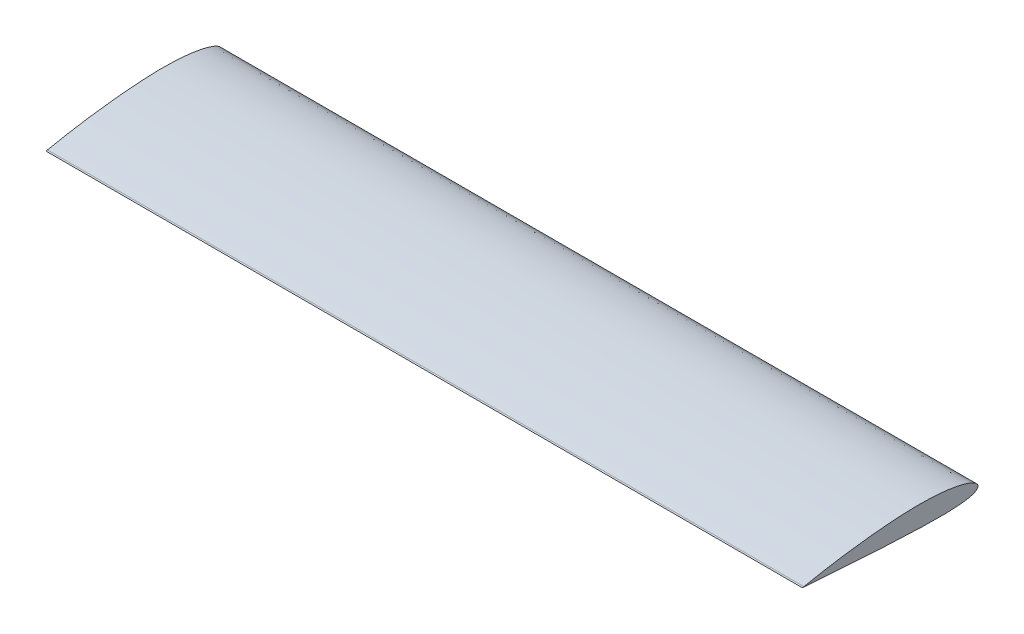
ISO-10303-21;
HEADER;
FILE_DESCRIPTION(('STEP AP214'),'2;1');
FILE_NAME('part.step','',(''),(''),'','','');
FILE_SCHEMA(('AUTOMOTIVE_DESIGN { 1 0 10303 214 1 1 1 1 }'));
ENDSEC;
DATA;
#1=APPLICATION_CONTEXT('core data for automotive mechanical design processes');
#2=APPLICATION_PROTOCOL_DEFINITION('international standard','automotive_design',2000,#1);
#3=PRODUCT_CONTEXT('',#1,'mechanical');
#4=PRODUCT('Part','Part','',(#3));
#5=PRODUCT_RELATED_PRODUCT_CATEGORY('part','',(#4));
#6=PRODUCT_DEFINITION_FORMATION('','',#4);
#7=PRODUCT_DEFINITION_CONTEXT('part definition',#1,'design');
#8=PRODUCT_DEFINITION('design','',#6,#7);
#9=PRODUCT_DEFINITION_SHAPE('','',#8);
#10=(LENGTH_UNIT() NAMED_UNIT(*) SI_UNIT(.MILLI.,.METRE.));
#11=(NAMED_UNIT(*) PLANE_ANGLE_UNIT() SI_UNIT($,.RADIAN.));
#12=(NAMED_UNIT(*) SI_UNIT($,.STERADIAN.) SOLID_ANGLE_UNIT());
#13=UNCERTAINTY_MEASURE_WITH_UNIT(LENGTH_MEASURE(1.E-05),#10,'distance_accuracy_value','');
#14=(GEOMETRIC_REPRESENTATION_CONTEXT(3) GLOBAL_UNCERTAINTY_ASSIGNED_CONTEXT((#13)) GLOBAL_UNIT_ASSIGNED_CONTEXT((#10,
#11,#12)) REPRESENTATION_CONTEXT('',''));
#15=CARTESIAN_POINT('',(0.,0.,0.));
#16=DIRECTION('',(0.,0.,1.));
#17=DIRECTION('',(1.,0.,0.));
#18=AXIS2_PLACEMENT_3D('',#15,#16,#17);
#19=CARTESIAN_POINT('',(1000.,-0.57822,459.96136));
#20=CARTESIAN_POINT('',(1000.,-0.595546201064765,459.722926633538));
#21=CARTESIAN_POINT('',(1000.,-0.664750446535169,458.770577000786));
#22=CARTESIAN_POINT('',(1000.,-0.820097255996696,456.633473904951));
#23=CARTESIAN_POINT('',(1000.,-1.07534391474096,453.087022947326));
#24=CARTESIAN_POINT('',(1000.,-1.42904485861535,448.154516429648));
#25=CARTESIAN_POINT('',(1000.,-1.87534160046032,441.868019551717));
#26=CARTESIAN_POINT('',(1000.,-2.41063614763183,434.268423290275));
#27=CARTESIAN_POINT('',(1000.,-3.02832414407909,425.404870433179));
#28=CARTESIAN_POINT('',(1000.,-3.72250159129677,415.334397244788));
#29=CARTESIAN_POINT('',(1000.,-4.48816981443587,404.121471111217));
#30=CARTESIAN_POINT('',(1000.,-5.31801226489666,391.837751080439));
#31=CARTESIAN_POINT('',(1000.,-6.20789426904348,378.56128593132));
#32=CARTESIAN_POINT('',(1000.,-7.14892944368918,364.376091401711));
#33=CARTESIAN_POINT('',(1000.,-8.13611252478126,349.37141060841));
#34=CARTESIAN_POINT('',(1000.,-9.16036931936446,333.64146900815));
#35=CARTESIAN_POINT('',(1000.,-10.2130313140034,317.284462612016));
#36=CARTESIAN_POINT('',(1000.,-11.2828230425378,300.402068620946));
#37=CARTESIAN_POINT('',(1000.,-12.3546879740502,283.098611655093));
#38=CARTESIAN_POINT('',(1000.,-13.4148938429502,265.480797863899));
#39=CARTESIAN_POINT('',(1000.,-14.4427416600801,247.656722582026));
#40=CARTESIAN_POINT('',(1000.,-15.41954298534,229.735221004216));
#41=CARTESIAN_POINT('',(1000.,-16.3175433696275,211.825044664784));
#42=CARTESIAN_POINT('',(1000.,-17.1171729174978,194.055351039072));
#43=CARTESIAN_POINT('',(1000.,-17.7784070462407,176.559622724169));
#44=CARTESIAN_POINT('',(1000.,-18.3821806374611,159.445496034057));
#45=CARTESIAN_POINT('',(1000.,-18.8863453183243,142.790888208118));
#46=CARTESIAN_POINT('',(1000.,-19.2643358170726,126.664381158158));
#47=CARTESIAN_POINT('',(1000.,-19.4833451509986,111.157748758866));
#48=CARTESIAN_POINT('',(1000.,-19.5166912406896,96.3593078576507));
#49=CARTESIAN_POINT('',(1000.,-19.337915860042,82.3537795065244));
#50=CARTESIAN_POINT('',(1000.,-18.9276132990026,69.2218030676485));
#51=CARTESIAN_POINT('',(1000.,-18.2686902362068,57.0399261441836));
#52=CARTESIAN_POINT('',(1000.,-17.3506381049654,45.8798657132097));
#53=CARTESIAN_POINT('',(1000.,-16.1657077336599,35.8081819993711));
#54=CARTESIAN_POINT('',(1000.,-14.7119962857562,26.8852921936776));
#55=CARTESIAN_POINT('',(1000.,-12.9908095825222,19.1637052686143));
#56=CARTESIAN_POINT('',(1000.,-11.0065243272819,12.6856393324366));
#57=CARTESIAN_POINT('',(1000.,-8.7569038403763,7.47821590859919));
#58=CARTESIAN_POINT('',(1000.,-6.23046498881112,3.55014802399322));
#59=CARTESIAN_POINT('',(1000.,-3.34511785643728,0.902718938149594));
#60=CARTESIAN_POINT('',(1000.,-0.0262679214766239,-0.262262833066601));
#61=CARTESIAN_POINT('',(1000.,3.46075278320734,0.22334044441311));
#62=CARTESIAN_POINT('',(1000.,6.81404068614428,2.26861760929261));
#63=CARTESIAN_POINT('',(1000.,10.0569976368771,5.6671116034625));
#64=CARTESIAN_POINT('',(1000.,13.2541060266416,10.416631233785));
#65=CARTESIAN_POINT('',(1000.,16.3986940706502,16.5144729539643));
#66=CARTESIAN_POINT('',(1000.,19.4595480473288,23.9454326511999));
#67=CARTESIAN_POINT('',(1000.,22.3959258336671,32.6748608018245));
#68=CARTESIAN_POINT('',(1000.,25.1611831983686,42.6566076203779));
#69=CARTESIAN_POINT('',(1000.,27.7126134163392,53.8315990565819));
#70=CARTESIAN_POINT('',(1000.,30.0044835376801,66.1323734849929));
#71=CARTESIAN_POINT('',(1000.,31.9979313574114,79.4811032247787));
#72=CARTESIAN_POINT('',(1000.,33.6576842455689,93.7922020979673));
#73=CARTESIAN_POINT('',(1000.,34.9558833702082,108.972143146884));
#74=CARTESIAN_POINT('',(1000.,35.8696929379504,124.921332833881));
#75=CARTESIAN_POINT('',(1000.,36.3855250637185,141.534269901525));
#76=CARTESIAN_POINT('',(1000.,36.4971322300513,158.701138058617));
#77=CARTESIAN_POINT('',(1000.,36.207087084995,176.282304318349));
#78=CARTESIAN_POINT('',(1000.,35.5176780689537,194.141133769773));
#79=CARTESIAN_POINT('',(1000.,34.5557033069161,212.167609701362));
#80=CARTESIAN_POINT('',(1000.,33.3336597867544,230.275245945925));
#81=CARTESIAN_POINT('',(1000.,31.880450428852,248.371165835517));
#82=CARTESIAN_POINT('',(1000.,30.2198271390663,266.342124234926));
#83=CARTESIAN_POINT('',(1000.,28.3853068495781,284.076486433119));
#84=CARTESIAN_POINT('',(1000.,26.4035574067418,301.464229530884));
#85=CARTESIAN_POINT('',(1000.,24.3092612062564,318.398290140492));
#86=CARTESIAN_POINT('',(1000.,22.1323738571071,334.774661071771));
#87=CARTESIAN_POINT('',(1000.,19.9051051501624,350.493218457132));
#88=CARTESIAN_POINT('',(1000.,17.6608430753493,365.458406812589));
#89=CARTESIAN_POINT('',(1000.,15.4318192121894,379.579206865228));
#90=CARTESIAN_POINT('',(1000.,13.250829113558,392.770491908562));
#91=CARTESIAN_POINT('',(1000.,11.1514360991052,404.953123159227));
#92=CARTESIAN_POINT('',(1000.,9.16541605825495,416.054516581583));
#93=CARTESIAN_POINT('',(1000.,7.32369837103478,426.008341953398));
#94=CARTESIAN_POINT('',(1000.,5.65763481007658,434.756002280408));
#95=CARTESIAN_POINT('',(1000.,4.19430067339885,442.24599338));
#96=CARTESIAN_POINT('',(1000.,2.95894186603859,448.434337026262));
#97=CARTESIAN_POINT('',(1000.,1.97457405051952,453.28530188676));
#98=CARTESIAN_POINT('',(1000.,1.25748810221199,456.77023400302));
#99=CARTESIAN_POINT('',(1000.,0.821814131438473,458.86928327524));
#100=CARTESIAN_POINT('',(1000.,0.62699417607731,459.804502952224));
#101=CARTESIAN_POINT('',(1000.,0.57822,460.03864));
#102=B_SPLINE_CURVE_WITH_KNOTS('',3,(#19,#20,#21,#22,#23,#24,#25,#26,#27,#28,#29,#30,#31,#32,
#33,#34,#35,#36,#37,#38,#39,#40,#41,#42,#43,#44,#45,#46,#47,#48,#49,#50,#51,#52,#53,#54,#55,#56,
#57,#58,#59,#60,#61,#62,#63,#64,#65,#66,#67,#68,#69,#70,#71,#72,#73,#74,#75,#76,#77,#78,#79,#80,
#81,#82,#83,#84,#85,#86,#87,#88,#89,#90,#91,#92,#93,#94,#95,#96,#97,#98,#99,#100,#101),
.UNSPECIFIED.,.F.,.F.,(4,1,1,1,1,1,1,1,1,1,1,1,1,1,1,1,1,1,1,1,1,1,1,1,1,1,1,1,1,1,1,1,1,1,1,1,
1,1,1,1,1,1,1,1,1,1,1,1,1,1,1,1,1,1,1,1,1,1,1,1,1,1,1,1,1,1,1,1,1,1,1,1,1,1,1,1,1,1,1,1,4),(0.,
0.000763849001500838,0.00305096273583516,0.00684646955224621,0.0121247484862888,
0.0188517323013395,0.0269835822459312,0.036467072952227,0.0472411623624426,0.0592370237492688,
0.0723779439548288,0.0865794557279205,0.101753050357609,0.117801975084679,0.134625927408028,
0.15211965624753,0.170173849863638,0.188676584211923,0.207513463209848,0.226567927798734,
0.245722459831779,0.264860936987902,0.283866077458523,0.302557043653414,0.320802791746688,
0.338582940766319,0.355795759860566,0.372343677759343,0.388133630608251,0.403078328240631,
0.417095611775281,0.430110357882856,0.442054549095498,0.452868818715277,0.462505009146628,
0.470928785019175,0.478127761278921,0.484123875338212,0.488999972182062,0.492959403174825,
0.496412777697822,0.499866609506216,0.503832176080471,0.508732461778435,0.51477966167091,
0.522066384116654,0.530620554720804,0.540434572011856,0.551477175550533,0.563701851231184,
0.577048547245343,0.591447280896427,0.606818147252312,0.623074182281721,0.640120289431202,
0.657856183183399,0.676175563379063,0.694967819833854,0.714033957187982,0.733277175195403,
0.752646098718606,0.772021105338392,0.7912817902148,0.810310109979621,0.828987081513378,
0.847197702829786,0.864829110746378,0.881772296963255,0.897922602456206,0.913179947694549,
0.927449194878037,0.940643128994877,0.952679251989813,0.963483187916785,0.972987160696187,
0.981132008479951,0.987867526601434,0.993150194295179,0.996947646215246,0.999235827558466,1.),.UNSPECIFIED.);
#103=DIRECTION('',(-1.,0.,0.));
#104=VECTOR('',#103,1.);
#105=SURFACE_OF_LINEAR_EXTRUSION('',#102,#104);
#106=CARTESIAN_POINT('',(-1000.,-0.57822,459.96136));
#107=CARTESIAN_POINT('',(-1000.,-0.595546201064765,459.722926633538));
#108=CARTESIAN_POINT('',(-1000.,-0.664750446535169,458.770577000786));
#109=CARTESIAN_POINT('',(-1000.,-0.820097255996696,456.633473904951));
#110=CARTESIAN_POINT('',(-1000.,-1.07534391474096,453.087022947326));
#111=CARTESIAN_POINT('',(-1000.,-1.42904485861535,448.154516429648));
#112=CARTESIAN_POINT('',(-1000.,-1.87534160046032,441.868019551717));
#113=CARTESIAN_POINT('',(-1000.,-2.41063614763183,434.268423290275));
#114=CARTESIAN_POINT('',(-1000.,-3.02832414407909,425.404870433179));
#115=CARTESIAN_POINT('',(-1000.,-3.72250159129677,415.334397244788));
#116=CARTESIAN_POINT('',(-1000.,-4.48816981443587,404.121471111217));
#117=CARTESIAN_POINT('',(-1000.,-5.31801226489666,391.837751080439));
#118=CARTESIAN_POINT('',(-1000.,-6.20789426904348,378.56128593132));
#119=CARTESIAN_POINT('',(-1000.,-7.14892944368918,364.376091401711));
#120=CARTESIAN_POINT('',(-1000.,-8.13611252478126,349.37141060841));
#121=CARTESIAN_POINT('',(-1000.,-9.16036931936446,333.64146900815));
#122=CARTESIAN_POINT('',(-1000.,-10.2130313140034,317.284462612016));
#123=CARTESIAN_POINT('',(-1000.,-11.2828230425378,300.402068620946));
#124=CARTESIAN_POINT('',(-1000.,-12.3546879740502,283.098611655093));
#125=CARTESIAN_POINT('',(-1000.,-13.4148938429502,265.480797863899));
#126=CARTESIAN_POINT('',(-1000.,-14.4427416600801,247.656722582026));
#127=CARTESIAN_POINT('',(-1000.,-15.41954298534,229.735221004216));
#128=CARTESIAN_POINT('',(-1000.,-16.3175433696275,211.825044664784));
#129=CARTESIAN_POINT('',(-1000.,-17.1171729174978,194.055351039072));
#130=CARTESIAN_POINT('',(-1000.,-17.7784070462407,176.559622724169));
#131=CARTESIAN_POINT('',(-1000.,-18.3821806374611,159.445496034057));
#132=CARTESIAN_POINT('',(-1000.,-18.8863453183243,142.790888208118));
#133=CARTESIAN_POINT('',(-1000.,-19.2643358170726,126.664381158158));
#134=CARTESIAN_POINT('',(-1000.,-19.4833451509986,111.157748758866));
#135=CARTESIAN_POINT('',(-1000.,-19.5166912406896,96.3593078576507));
#136=CARTESIAN_POINT('',(-1000.,-19.337915860042,82.3537795065244));
#137=CARTESIAN_POINT('',(-1000.,-18.9276132990026,69.2218030676485));
#138=CARTESIAN_POINT('',(-1000.,-18.2686902362068,57.0399261441836));
#139=CARTESIAN_POINT('',(-1000.,-17.3506381049654,45.8798657132097));
#140=CARTESIAN_POINT('',(-1000.,-16.1657077336599,35.8081819993711));
#141=CARTESIAN_POINT('',(-1000.,-14.7119962857562,26.8852921936776));
#142=CARTESIAN_POINT('',(-1000.,-12.9908095825222,19.1637052686143));
#143=CARTESIAN_POINT('',(-1000.,-11.0065243272819,12.6856393324366));
#144=CARTESIAN_POINT('',(-1000.,-8.7569038403763,7.47821590859919));
#145=CARTESIAN_POINT('',(-1000.,-6.23046498881112,3.55014802399322));
#146=CARTESIAN_POINT('',(-1000.,-3.34511785643728,0.902718938149594));
#147=CARTESIAN_POINT('',(-1000.,-0.0262679214766239,-0.262262833066601));
#148=CARTESIAN_POINT('',(-1000.,3.46075278320734,0.22334044441311));
#149=CARTESIAN_POINT('',(-1000.,6.81404068614428,2.26861760929261));
#150=CARTESIAN_POINT('',(-1000.,10.0569976368771,5.6671116034625));
#151=CARTESIAN_POINT('',(-1000.,13.2541060266416,10.416631233785));
#152=CARTESIAN_POINT('',(-1000.,16.3986940706502,16.5144729539643));
#153=CARTESIAN_POINT('',(-1000.,19.4595480473288,23.9454326511999));
#154=CARTESIAN_POINT('',(-1000.,22.3959258336671,32.6748608018245));
#155=CARTESIAN_POINT('',(-1000.,25.1611831983686,42.6566076203779));
#156=CARTESIAN_POINT('',(-1000.,27.7126134163392,53.8315990565819));
#157=CARTESIAN_POINT('',(-1000.,30.0044835376801,66.1323734849929));
#158=CARTESIAN_POINT('',(-1000.,31.9979313574114,79.4811032247787));
#159=CARTESIAN_POINT('',(-1000.,33.6576842455689,93.7922020979673));
#160=CARTESIAN_POINT('',(-1000.,34.9558833702082,108.972143146884));
#161=CARTESIAN_POINT('',(-1000.,35.8696929379504,124.921332833881));
#162=CARTESIAN_POINT('',(-1000.,36.3855250637185,141.534269901525));
#163=CARTESIAN_POINT('',(-1000.,36.4971322300513,158.701138058617));
#164=CARTESIAN_POINT('',(-1000.,36.207087084995,176.282304318349));
#165=CARTESIAN_POINT('',(-1000.,35.5176780689537,194.141133769773));
#166=CARTESIAN_POINT('',(-1000.,34.5557033069161,212.167609701362));
#167=CARTESIAN_POINT('',(-1000.,33.3336597867544,230.275245945925));
#168=CARTESIAN_POINT('',(-1000.,31.880450428852,248.371165835517));
#169=CARTESIAN_POINT('',(-1000.,30.2198271390663,266.342124234926));
#170=CARTESIAN_POINT('',(-1000.,28.3853068495781,284.076486433119));
#171=CARTESIAN_POINT('',(-1000.,26.4035574067418,301.464229530884));
#172=CARTESIAN_POINT('',(-1000.,24.3092612062564,318.398290140492));
#173=CARTESIAN_POINT('',(-1000.,22.1323738571071,334.774661071771));
#174=CARTESIAN_POINT('',(-1000.,19.9051051501624,350.493218457132));
#175=CARTESIAN_POINT('',(-1000.,17.6608430753493,365.458406812589));
#176=CARTESIAN_POINT('',(-1000.,15.4318192121894,379.579206865228));
#177=CARTESIAN_POINT('',(-1000.,13.250829113558,392.770491908562));
#178=CARTESIAN_POINT('',(-1000.,11.1514360991052,404.953123159227));
#179=CARTESIAN_POINT('',(-1000.,9.16541605825495,416.054516581583));
#180=CARTESIAN_POINT('',(-1000.,7.32369837103478,426.008341953398));
#181=CARTESIAN_POINT('',(-1000.,5.65763481007658,434.756002280408));
#182=CARTESIAN_POINT('',(-1000.,4.19430067339885,442.24599338));
#183=CARTESIAN_POINT('',(-1000.,2.95894186603859,448.434337026262));
#184=CARTESIAN_POINT('',(-1000.,1.97457405051952,453.28530188676));
#185=CARTESIAN_POINT('',(-1000.,1.25748810221199,456.77023400302));
#186=CARTESIAN_POINT('',(-1000.,0.821814131438473,458.86928327524));
#187=CARTESIAN_POINT('',(-1000.,0.62699417607731,459.804502952224));
#188=CARTESIAN_POINT('',(-1000.,0.57822,460.03864));
#189=B_SPLINE_CURVE_WITH_KNOTS('',3,(#106,#107,#108,#109,#110,#111,#112,#113,#114,#115,#116,
#117,#118,#119,#120,#121,#122,#123,#124,#125,#126,#127,#128,#129,#130,#131,#132,#133,#134,#135,
#136,#137,#138,#139,#140,#141,#142,#143,#144,#145,#146,#147,#148,#149,#150,#151,#152,#153,#154,
#155,#156,#157,#158,#159,#160,#161,#162,#163,#164,#165,#166,#167,#168,#169,#170,#171,#172,#173,
#174,#175,#176,#177,#178,#179,#180,#181,#182,#183,#184,#185,#186,#187,#188),.UNSPECIFIED.,.F.,
.F.,(4,1,1,1,1,1,1,1,1,1,1,1,1,1,1,1,1,1,1,1,1,1,1,1,1,1,1,1,1,1,1,1,1,1,1,1,1,1,1,1,1,1,1,1,1,
1,1,1,1,1,1,1,1,1,1,1,1,1,1,1,1,1,1,1,1,1,1,1,1,1,1,1,1,1,1,1,1,1,1,1,4),(0.,
0.000763849001500838,0.00305096273583516,0.00684646955224621,0.0121247484862888,
0.0188517323013395,0.0269835822459312,0.036467072952227,0.0472411623624426,0.0592370237492688,
0.0723779439548288,0.0865794557279205,0.101753050357609,0.117801975084679,0.134625927408028,
0.15211965624753,0.170173849863638,0.188676584211923,0.207513463209848,0.226567927798734,
0.245722459831779,0.264860936987902,0.283866077458523,0.302557043653414,0.320802791746688,
0.338582940766319,0.355795759860566,0.372343677759343,0.388133630608251,0.403078328240631,
0.417095611775281,0.430110357882856,0.442054549095498,0.452868818715277,0.462505009146628,
0.470928785019175,0.478127761278921,0.484123875338212,0.488999972182062,0.492959403174825,
0.496412777697822,0.499866609506216,0.503832176080471,0.508732461778435,0.51477966167091,
0.522066384116654,0.530620554720804,0.540434572011856,0.551477175550533,0.563701851231184,
0.577048547245343,0.591447280896427,0.606818147252312,0.623074182281721,0.640120289431202,
0.657856183183399,0.676175563379063,0.694967819833854,0.714033957187982,0.733277175195403,
0.752646098718606,0.772021105338392,0.7912817902148,0.810310109979621,0.828987081513378,
0.847197702829786,0.864829110746378,0.881772296963255,0.897922602456206,0.913179947694549,
0.927449194878037,0.940643128994877,0.952679251989813,0.963483187916785,0.972987160696187,
0.981132008479951,0.987867526601434,0.993150194295179,0.996947646215246,0.999235827558466,1.),.UNSPECIFIED.);
#190=CARTESIAN_POINT('',(-1000.,-0.57822,459.96136));
#191=VERTEX_POINT('',#190);
#192=CARTESIAN_POINT('',(-1000.,0.57822,460.03864));
#193=VERTEX_POINT('',#192);
#194=EDGE_CURVE('E95',#191,#193,#189,.T.);
#195=ORIENTED_EDGE('',*,*,#194,.T.);
#196=DIRECTION('',(-1.,0.,0.));
#197=VECTOR('',#196,1.);
#198=CARTESIAN_POINT('',(1000.,0.57822,460.03864));
#199=LINE('',#198,#197);
#200=CARTESIAN_POINT('',(1000.,0.57822,460.03864));
#201=VERTEX_POINT('',#200);
#202=EDGE_CURVE('E11',#201,#193,#199,.T.);
#203=ORIENTED_EDGE('',*,*,#202,.F.);
#204=CARTESIAN_POINT('',(1000.,-0.57822,459.96136));
#205=VERTEX_POINT('',#204);
#206=EDGE_CURVE('E88',#205,#201,#102,.T.);
#207=ORIENTED_EDGE('',*,*,#206,.F.);
#208=DIRECTION('',(-1.,0.,0.));
#209=VECTOR('',#208,1.);
#210=CARTESIAN_POINT('',(1000.,-0.57822,459.96136));
#211=LINE('',#210,#209);
#212=EDGE_CURVE('E96',#205,#191,#211,.T.);
#213=ORIENTED_EDGE('',*,*,#212,.T.);
#214=EDGE_LOOP('',(#195,#203,#207,#213));
#215=FACE_BOUND('',#214,.T.);
#216=ADVANCED_FACE('F45',(#215),#105,.F.);
#217=CARTESIAN_POINT('',(1000.,0.57822,460.03864));
#218=DIRECTION('',(0.,-0.978984072534473,-0.203936719900603));
#219=DIRECTION('',(0.,0.203936719900603,-0.978984072534473));
#220=AXIS2_PLACEMENT_3D('',#217,#218,#219);
#221=PLANE('',#220);
#222=DIRECTION('',(0.,-0.203936719900603,0.978984072534473));
#223=VECTOR('',#222,1.);
#224=CARTESIAN_POINT('',(-1000.,0.57822,460.03864));
#225=LINE('',#224,#223);
#226=CARTESIAN_POINT('',(-1000.,-0.259696924143734,464.06100205056));
#227=VERTEX_POINT('',#226);
#228=EDGE_CURVE('E75',#193,#227,#225,.T.);
#229=ORIENTED_EDGE('',*,*,#228,.T.);
#230=DIRECTION('',(-1.,0.,0.));
#231=VECTOR('',#230,1.);
#232=CARTESIAN_POINT('',(1000.,-0.259696924143734,464.06100205056));
#233=LINE('',#232,#231);
#234=CARTESIAN_POINT('',(1000.,-0.259696924143734,464.06100205056));
#235=VERTEX_POINT('',#234);
#236=EDGE_CURVE('E55',#235,#227,#233,.T.);
#237=ORIENTED_EDGE('',*,*,#236,.F.);
#238=DIRECTION('',(0.,-0.203936719900603,0.978984072534473));
#239=VECTOR('',#238,1.);
#240=CARTESIAN_POINT('',(1000.,0.57822,460.03864));
#241=LINE('',#240,#239);
#242=EDGE_CURVE('E83',#201,#235,#241,.T.);
#243=ORIENTED_EDGE('',*,*,#242,.F.);
#244=ORIENTED_EDGE('',*,*,#202,.T.);
#245=EDGE_LOOP('',(#229,#237,#243,#244));
#246=FACE_BOUND('',#245,.T.);
#247=ADVANCED_FACE('F84',(#246),#221,.F.);
#248=CARTESIAN_POINT('',(1000.,-0.57822,459.96136));
#249=DIRECTION('',(0.,0.996995313872502,-0.0774618881532858));
#250=DIRECTION('',(0.,0.0774618881532858,0.996995313872502));
#251=AXIS2_PLACEMENT_3D('',#248,#249,#250);
#252=PLANE('',#251);
#253=DIRECTION('',(0.,-0.0774618881532858,-0.996995313872502));
#254=VECTOR('',#253,1.);
#255=CARTESIAN_POINT('',(-1000.,-0.57822,459.96136));
#256=LINE('',#255,#254);
#257=EDGE_CURVE('E80',#227,#191,#256,.T.);
#258=ORIENTED_EDGE('',*,*,#257,.T.);
#259=ORIENTED_EDGE('',*,*,#212,.F.);
#260=DIRECTION('',(0.,-0.0774618881532858,-0.996995313872502));
#261=VECTOR('',#260,1.);
#262=CARTESIAN_POINT('',(1000.,-0.57822,459.96136));
#263=LINE('',#262,#261);
#264=EDGE_CURVE('E63',#235,#205,#263,.T.);
#265=ORIENTED_EDGE('',*,*,#264,.F.);
#266=ORIENTED_EDGE('',*,*,#236,.T.);
#267=EDGE_LOOP('',(#258,#259,#265,#266));
#268=FACE_BOUND('',#267,.T.);
#269=ADVANCED_FACE('F113',(#268),#252,.F.);
#270=CARTESIAN_POINT('',(1000.,3.33757172506848,0.436946661892542));
#271=DIRECTION('',(1.,0.,0.));
#272=DIRECTION('',(0.,0.,-1.));
#273=AXIS2_PLACEMENT_3D('',#270,#271,#272);
#274=PLANE('',#273);
#275=ORIENTED_EDGE('',*,*,#206,.T.);
#276=ORIENTED_EDGE('',*,*,#242,.T.);
#277=ORIENTED_EDGE('',*,*,#264,.T.);
#278=EDGE_LOOP('',(#275,#276,#277));
#279=FACE_BOUND('',#278,.T.);
#280=ADVANCED_FACE('F91',(#279),#274,.T.);
#281=CARTESIAN_POINT('',(-1000.,3.33757172506848,0.436946661892542));
#282=DIRECTION('',(1.,0.,0.));
#283=DIRECTION('',(0.,0.,-1.));
#284=AXIS2_PLACEMENT_3D('',#281,#282,#283);
#285=PLANE('',#284);
#286=ORIENTED_EDGE('',*,*,#194,.F.);
#287=ORIENTED_EDGE('',*,*,#257,.F.);
#288=ORIENTED_EDGE('',*,*,#228,.F.);
#289=EDGE_LOOP('',(#286,#287,#288));
#290=FACE_BOUND('',#289,.T.);
#291=ADVANCED_FACE('F114',(#290),#285,.F.);
#292=CLOSED_SHELL('',(#216,#247,#269,#280,#291));
#293=MANIFOLD_SOLID_BREP('B2',#292);
#294=ADVANCED_BREP_SHAPE_REPRESENTATION('',(#18,#293),#14);
#295=SHAPE_DEFINITION_REPRESENTATION(#9,#294);
ENDSEC;
END-ISO-10303-21;
